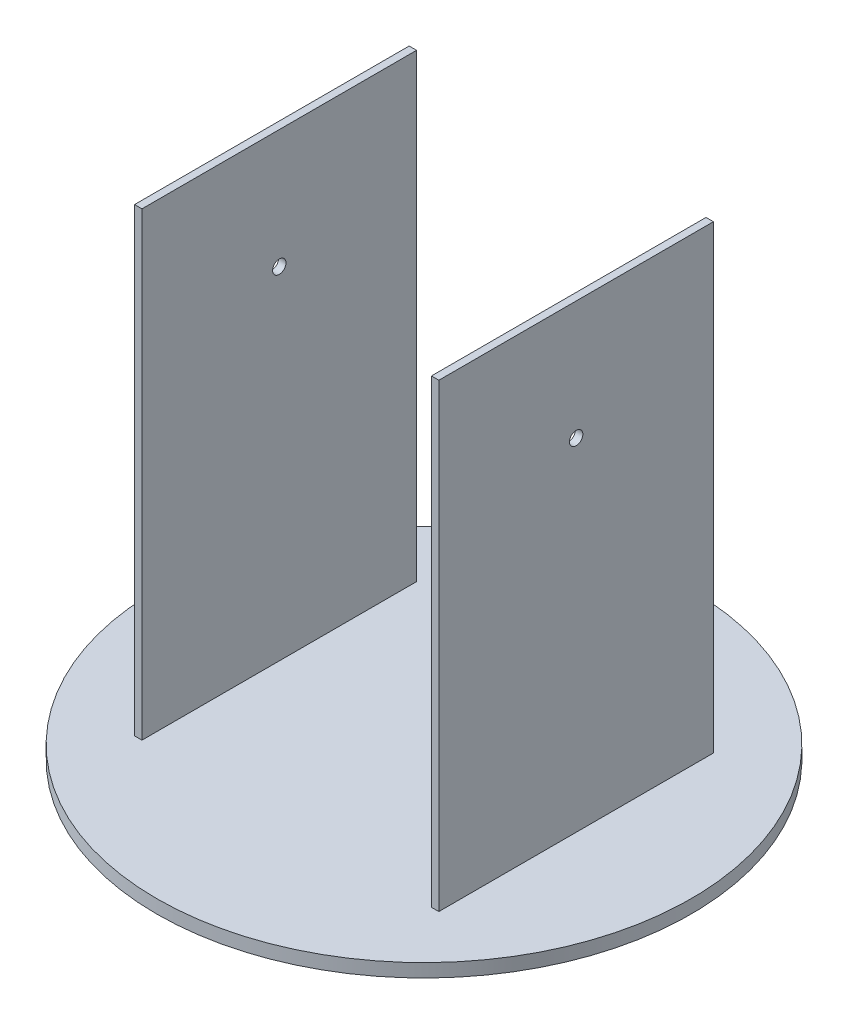
ISO-10303-21;
HEADER;
FILE_DESCRIPTION(('STEP AP214'),'2;1');
FILE_NAME('part.step','',(''),(''),'','','');
FILE_SCHEMA(('AUTOMOTIVE_DESIGN { 1 0 10303 214 1 1 1 1 }'));
ENDSEC;
DATA;
#1=APPLICATION_CONTEXT('core data for automotive mechanical design processes');
#2=APPLICATION_PROTOCOL_DEFINITION('international standard','automotive_design',2000,#1);
#3=PRODUCT_CONTEXT('',#1,'mechanical');
#4=PRODUCT('Part','Part','',(#3));
#5=PRODUCT_RELATED_PRODUCT_CATEGORY('part','',(#4));
#6=PRODUCT_DEFINITION_FORMATION('','',#4);
#7=PRODUCT_DEFINITION_CONTEXT('part definition',#1,'design');
#8=PRODUCT_DEFINITION('design','',#6,#7);
#9=PRODUCT_DEFINITION_SHAPE('','',#8);
#10=(LENGTH_UNIT() NAMED_UNIT(*) SI_UNIT(.MILLI.,.METRE.));
#11=(NAMED_UNIT(*) PLANE_ANGLE_UNIT() SI_UNIT($,.RADIAN.));
#12=(NAMED_UNIT(*) SI_UNIT($,.STERADIAN.) SOLID_ANGLE_UNIT());
#13=UNCERTAINTY_MEASURE_WITH_UNIT(LENGTH_MEASURE(1.E-05),#10,'distance_accuracy_value','');
#14=(GEOMETRIC_REPRESENTATION_CONTEXT(3) GLOBAL_UNCERTAINTY_ASSIGNED_CONTEXT((#13)) GLOBAL_UNIT_ASSIGNED_CONTEXT((#10,
#11,#12)) REPRESENTATION_CONTEXT('',''));
#15=CARTESIAN_POINT('',(0.,0.,0.));
#16=DIRECTION('',(0.,0.,1.));
#17=DIRECTION('',(1.,0.,0.));
#18=AXIS2_PLACEMENT_3D('',#15,#16,#17);
#19=CARTESIAN_POINT('',(0.,0.,0.));
#20=DIRECTION('',(0.,1.,0.));
#21=DIRECTION('',(0.,0.,1.));
#22=AXIS2_PLACEMENT_3D('',#19,#20,#21);
#23=PLANE('',#22);
#24=DIRECTION('',(0.,0.,-1.));
#25=VECTOR('',#24,1.);
#26=CARTESIAN_POINT('',(-102.5,0.,92.5000000000001));
#27=LINE('',#26,#25);
#28=CARTESIAN_POINT('',(-102.5,0.,92.5000000000001));
#29=VERTEX_POINT('',#28);
#30=CARTESIAN_POINT('',(-102.5,0.,-92.4999999999999));
#31=VERTEX_POINT('',#30);
#32=EDGE_CURVE('E103',#29,#31,#27,.T.);
#33=ORIENTED_EDGE('',*,*,#32,.T.);
#34=DIRECTION('',(1.,0.,0.));
#35=VECTOR('',#34,1.);
#36=CARTESIAN_POINT('',(-102.5,0.,-92.4999999999999));
#37=LINE('',#36,#35);
#38=CARTESIAN_POINT('',(-97.5,0.,-92.4999999999999));
#39=VERTEX_POINT('',#38);
#40=EDGE_CURVE('E143',#31,#39,#37,.T.);
#41=ORIENTED_EDGE('',*,*,#40,.T.);
#42=DIRECTION('',(0.,0.,1.));
#43=VECTOR('',#42,1.);
#44=CARTESIAN_POINT('',(-97.5,0.,-92.4999999999999));
#45=LINE('',#44,#43);
#46=CARTESIAN_POINT('',(-97.5,0.,92.5000000000001));
#47=VERTEX_POINT('',#46);
#48=EDGE_CURVE('E145',#39,#47,#45,.T.);
#49=ORIENTED_EDGE('',*,*,#48,.T.);
#50=DIRECTION('',(1.,0.,0.));
#51=VECTOR('',#50,1.);
#52=CARTESIAN_POINT('',(-102.5,0.,92.5000000000001));
#53=LINE('',#52,#51);
#54=EDGE_CURVE('E133',#29,#47,#53,.T.);
#55=ORIENTED_EDGE('',*,*,#54,.F.);
#56=EDGE_LOOP('',(#33,#41,#49,#55));
#57=FACE_BOUND('',#56,.T.);
#58=CARTESIAN_POINT('',(0.,0.,0.));
#59=DIRECTION('',(0.,1.,0.));
#60=DIRECTION('',(0.,0.,1.));
#61=AXIS2_PLACEMENT_3D('',#58,#59,#60);
#62=CIRCLE('',#61,180.);
#63=CARTESIAN_POINT('',(0.,0.,180.));
#64=VERTEX_POINT('',#63);
#65=EDGE_CURVE('E42',#64,#64,#62,.T.);
#66=ORIENTED_EDGE('',*,*,#65,.T.);
#67=EDGE_LOOP('',(#66));
#68=FACE_BOUND('',#67,.T.);
#69=DIRECTION('',(1.,0.,0.));
#70=VECTOR('',#69,1.);
#71=CARTESIAN_POINT('',(97.4999999999999,0.,92.5000000000001));
#72=LINE('',#71,#70);
#73=CARTESIAN_POINT('',(97.4999999999999,0.,92.5000000000001));
#74=VERTEX_POINT('',#73);
#75=CARTESIAN_POINT('',(102.5,0.,92.5000000000001));
#76=VERTEX_POINT('',#75);
#77=EDGE_CURVE('E50',#74,#76,#72,.T.);
#78=ORIENTED_EDGE('',*,*,#77,.F.);
#79=DIRECTION('',(0.,0.,1.));
#80=VECTOR('',#79,1.);
#81=CARTESIAN_POINT('',(97.5,0.,-92.4999999999999));
#82=LINE('',#81,#80);
#83=CARTESIAN_POINT('',(97.5,0.,-92.4999999999999));
#84=VERTEX_POINT('',#83);
#85=EDGE_CURVE('E96',#84,#74,#82,.T.);
#86=ORIENTED_EDGE('',*,*,#85,.F.);
#87=DIRECTION('',(1.,0.,0.));
#88=VECTOR('',#87,1.);
#89=CARTESIAN_POINT('',(97.5,0.,-92.4999999999999));
#90=LINE('',#89,#88);
#91=CARTESIAN_POINT('',(102.5,0.,-92.4999999999999));
#92=VERTEX_POINT('',#91);
#93=EDGE_CURVE('E99',#84,#92,#90,.T.);
#94=ORIENTED_EDGE('',*,*,#93,.T.);
#95=DIRECTION('',(0.,0.,-1.));
#96=VECTOR('',#95,1.);
#97=CARTESIAN_POINT('',(102.5,0.,92.5000000000001));
#98=LINE('',#97,#96);
#99=EDGE_CURVE('E55',#76,#92,#98,.T.);
#100=ORIENTED_EDGE('',*,*,#99,.F.);
#101=EDGE_LOOP('',(#78,#86,#94,#100));
#102=FACE_BOUND('',#101,.T.);
#103=ADVANCED_FACE('F33',(#57,#68,#102),#23,.T.);
#104=CARTESIAN_POINT('',(0.,-9.,0.));
#105=DIRECTION('',(0.,1.,0.));
#106=DIRECTION('',(0.,0.,1.));
#107=AXIS2_PLACEMENT_3D('',#104,#105,#106);
#108=CYLINDRICAL_SURFACE('',#107,180.);
#109=CARTESIAN_POINT('',(0.,-9.,0.));
#110=DIRECTION('',(0.,1.,0.));
#111=DIRECTION('',(0.,0.,1.));
#112=AXIS2_PLACEMENT_3D('',#109,#110,#111);
#113=CIRCLE('',#112,180.);
#114=CARTESIAN_POINT('',(0.,-9.,180.));
#115=VERTEX_POINT('',#114);
#116=EDGE_CURVE('E11',#115,#115,#113,.T.);
#117=ORIENTED_EDGE('',*,*,#116,.T.);
#118=EDGE_LOOP('',(#117));
#119=FACE_BOUND('',#118,.T.);
#120=ORIENTED_EDGE('',*,*,#65,.F.);
#121=EDGE_LOOP('',(#120));
#122=FACE_BOUND('',#121,.T.);
#123=ADVANCED_FACE('F35',(#119,#122),#108,.T.);
#124=CARTESIAN_POINT('',(0.,-9.,0.));
#125=DIRECTION('',(0.,1.,0.));
#126=DIRECTION('',(0.,0.,1.));
#127=AXIS2_PLACEMENT_3D('',#124,#125,#126);
#128=PLANE('',#127);
#129=ORIENTED_EDGE('',*,*,#116,.F.);
#130=EDGE_LOOP('',(#129));
#131=FACE_BOUND('',#130,.T.);
#132=ADVANCED_FACE('F164',(#131),#128,.F.);
#133=CARTESIAN_POINT('',(-102.5,310.,92.5000000000001));
#134=DIRECTION('',(-1.,0.,0.));
#135=DIRECTION('',(0.,0.,1.));
#136=AXIS2_PLACEMENT_3D('',#133,#134,#135);
#137=PLANE('',#136);
#138=CARTESIAN_POINT('',(-102.5,230.,0.));
#139=DIRECTION('',(-1.,0.,0.));
#140=DIRECTION('',(0.,0.,1.));
#141=AXIS2_PLACEMENT_3D('',#138,#139,#140);
#142=CIRCLE('',#141,4.5);
#143=CARTESIAN_POINT('',(-102.5,230.,4.50000000000007));
#144=VERTEX_POINT('',#143);
#145=EDGE_CURVE('E231',#144,#144,#142,.T.);
#146=ORIENTED_EDGE('',*,*,#145,.F.);
#147=EDGE_LOOP('',(#146));
#148=FACE_BOUND('',#147,.T.);
#149=ORIENTED_EDGE('',*,*,#32,.F.);
#150=DIRECTION('',(0.,-1.,0.));
#151=VECTOR('',#150,1.);
#152=CARTESIAN_POINT('',(-102.5,310.,92.5000000000001));
#153=LINE('',#152,#151);
#154=CARTESIAN_POINT('',(-102.5,310.,92.5000000000001));
#155=VERTEX_POINT('',#154);
#156=EDGE_CURVE('E149',#155,#29,#153,.T.);
#157=ORIENTED_EDGE('',*,*,#156,.F.);
#158=DIRECTION('',(0.,0.,-1.));
#159=VECTOR('',#158,1.);
#160=CARTESIAN_POINT('',(-102.5,310.,92.5000000000001));
#161=LINE('',#160,#159);
#162=CARTESIAN_POINT('',(-102.5,310.,-92.4999999999999));
#163=VERTEX_POINT('',#162);
#164=EDGE_CURVE('E129',#155,#163,#161,.T.);
#165=ORIENTED_EDGE('',*,*,#164,.T.);
#166=DIRECTION('',(0.,-1.,0.));
#167=VECTOR('',#166,1.);
#168=CARTESIAN_POINT('',(-102.5,310.,-92.4999999999999));
#169=LINE('',#168,#167);
#170=EDGE_CURVE('E141',#163,#31,#169,.T.);
#171=ORIENTED_EDGE('',*,*,#170,.T.);
#172=EDGE_LOOP('',(#149,#157,#165,#171));
#173=FACE_BOUND('',#172,.T.);
#174=ADVANCED_FACE('F170',(#148,#173),#137,.T.);
#175=CARTESIAN_POINT('',(-102.5,310.,92.5000000000001));
#176=DIRECTION('',(0.,0.,-1.));
#177=DIRECTION('',(-1.,0.,0.));
#178=AXIS2_PLACEMENT_3D('',#175,#176,#177);
#179=PLANE('',#178);
#180=ORIENTED_EDGE('',*,*,#54,.T.);
#181=DIRECTION('',(0.,-1.,0.));
#182=VECTOR('',#181,1.);
#183=CARTESIAN_POINT('',(-97.5,310.,92.5000000000001));
#184=LINE('',#183,#182);
#185=CARTESIAN_POINT('',(-97.5,310.,92.5000000000001));
#186=VERTEX_POINT('',#185);
#187=EDGE_CURVE('E152',#186,#47,#184,.T.);
#188=ORIENTED_EDGE('',*,*,#187,.F.);
#189=DIRECTION('',(1.,0.,0.));
#190=VECTOR('',#189,1.);
#191=CARTESIAN_POINT('',(-102.5,310.,92.5000000000001));
#192=LINE('',#191,#190);
#193=EDGE_CURVE('E139',#155,#186,#192,.T.);
#194=ORIENTED_EDGE('',*,*,#193,.F.);
#195=ORIENTED_EDGE('',*,*,#156,.T.);
#196=EDGE_LOOP('',(#180,#188,#194,#195));
#197=FACE_BOUND('',#196,.T.);
#198=ADVANCED_FACE('F180',(#197),#179,.F.);
#199=CARTESIAN_POINT('',(-97.5,310.,-92.4999999999999));
#200=DIRECTION('',(1.,0.,0.));
#201=DIRECTION('',(0.,0.,-1.));
#202=AXIS2_PLACEMENT_3D('',#199,#200,#201);
#203=PLANE('',#202);
#204=CARTESIAN_POINT('',(-97.5,230.,0.));
#205=DIRECTION('',(1.,0.,0.));
#206=DIRECTION('',(0.,0.,-1.));
#207=AXIS2_PLACEMENT_3D('',#204,#205,#206);
#208=CIRCLE('',#207,4.5);
#209=CARTESIAN_POINT('',(-97.5,230.,-4.49999999999993));
#210=VERTEX_POINT('',#209);
#211=EDGE_CURVE('E228',#210,#210,#208,.T.);
#212=ORIENTED_EDGE('',*,*,#211,.F.);
#213=EDGE_LOOP('',(#212));
#214=FACE_BOUND('',#213,.T.);
#215=ORIENTED_EDGE('',*,*,#48,.F.);
#216=DIRECTION('',(0.,-1.,0.));
#217=VECTOR('',#216,1.);
#218=CARTESIAN_POINT('',(-97.5,310.,-92.4999999999999));
#219=LINE('',#218,#217);
#220=CARTESIAN_POINT('',(-97.5,310.,-92.4999999999999));
#221=VERTEX_POINT('',#220);
#222=EDGE_CURVE('E155',#221,#39,#219,.T.);
#223=ORIENTED_EDGE('',*,*,#222,.F.);
#224=DIRECTION('',(0.,0.,1.));
#225=VECTOR('',#224,1.);
#226=CARTESIAN_POINT('',(-97.5,310.,-92.4999999999999));
#227=LINE('',#226,#225);
#228=EDGE_CURVE('E136',#221,#186,#227,.T.);
#229=ORIENTED_EDGE('',*,*,#228,.T.);
#230=ORIENTED_EDGE('',*,*,#187,.T.);
#231=EDGE_LOOP('',(#215,#223,#229,#230));
#232=FACE_BOUND('',#231,.T.);
#233=ADVANCED_FACE('F186',(#214,#232),#203,.T.);
#234=CARTESIAN_POINT('',(-102.5,310.,-92.4999999999999));
#235=DIRECTION('',(0.,0.,-1.));
#236=DIRECTION('',(-1.,0.,0.));
#237=AXIS2_PLACEMENT_3D('',#234,#235,#236);
#238=PLANE('',#237);
#239=ORIENTED_EDGE('',*,*,#40,.F.);
#240=ORIENTED_EDGE('',*,*,#170,.F.);
#241=DIRECTION('',(1.,0.,0.));
#242=VECTOR('',#241,1.);
#243=CARTESIAN_POINT('',(-102.5,310.,-92.4999999999999));
#244=LINE('',#243,#242);
#245=EDGE_CURVE('E132',#163,#221,#244,.T.);
#246=ORIENTED_EDGE('',*,*,#245,.T.);
#247=ORIENTED_EDGE('',*,*,#222,.T.);
#248=EDGE_LOOP('',(#239,#240,#246,#247));
#249=FACE_BOUND('',#248,.T.);
#250=ADVANCED_FACE('F182',(#249),#238,.T.);
#251=CARTESIAN_POINT('',(0.,310.,0.));
#252=DIRECTION('',(0.,-1.,0.));
#253=DIRECTION('',(0.,0.,-1.));
#254=AXIS2_PLACEMENT_3D('',#251,#252,#253);
#255=PLANE('',#254);
#256=ORIENTED_EDGE('',*,*,#164,.F.);
#257=ORIENTED_EDGE('',*,*,#193,.T.);
#258=ORIENTED_EDGE('',*,*,#228,.F.);
#259=ORIENTED_EDGE('',*,*,#245,.F.);
#260=EDGE_LOOP('',(#256,#257,#258,#259));
#261=FACE_BOUND('',#260,.T.);
#262=ADVANCED_FACE('F185',(#261),#255,.F.);
#263=CARTESIAN_POINT('',(97.5,310.,-92.4999999999999));
#264=DIRECTION('',(1.,0.,0.));
#265=DIRECTION('',(0.,0.,-1.));
#266=AXIS2_PLACEMENT_3D('',#263,#264,#265);
#267=PLANE('',#266);
#268=CARTESIAN_POINT('',(97.5,230.,0.));
#269=DIRECTION('',(1.,0.,0.));
#270=DIRECTION('',(0.,0.,-1.));
#271=AXIS2_PLACEMENT_3D('',#268,#269,#270);
#272=CIRCLE('',#271,4.5);
#273=CARTESIAN_POINT('',(97.5,230.,-4.49999999999993));
#274=VERTEX_POINT('',#273);
#275=EDGE_CURVE('E227',#274,#274,#272,.T.);
#276=ORIENTED_EDGE('',*,*,#275,.T.);
#277=EDGE_LOOP('',(#276));
#278=FACE_BOUND('',#277,.T.);
#279=ORIENTED_EDGE('',*,*,#85,.T.);
#280=DIRECTION('',(0.,-1.,0.));
#281=VECTOR('',#280,1.);
#282=CARTESIAN_POINT('',(97.4999999999999,310.,92.5000000000001));
#283=LINE('',#282,#281);
#284=CARTESIAN_POINT('',(97.4999999999999,310.,92.5000000000001));
#285=VERTEX_POINT('',#284);
#286=EDGE_CURVE('E236',#285,#74,#283,.T.);
#287=ORIENTED_EDGE('',*,*,#286,.F.);
#288=DIRECTION('',(0.,0.,1.));
#289=VECTOR('',#288,1.);
#290=CARTESIAN_POINT('',(97.5,310.,-92.4999999999999));
#291=LINE('',#290,#289);
#292=CARTESIAN_POINT('',(97.5,310.,-92.4999999999999));
#293=VERTEX_POINT('',#292);
#294=EDGE_CURVE('E109',#293,#285,#291,.T.);
#295=ORIENTED_EDGE('',*,*,#294,.F.);
#296=DIRECTION('',(0.,-1.,0.));
#297=VECTOR('',#296,1.);
#298=CARTESIAN_POINT('',(97.5,310.,-92.4999999999999));
#299=LINE('',#298,#297);
#300=EDGE_CURVE('E106',#293,#84,#299,.T.);
#301=ORIENTED_EDGE('',*,*,#300,.T.);
#302=EDGE_LOOP('',(#279,#287,#295,#301));
#303=FACE_BOUND('',#302,.T.);
#304=ADVANCED_FACE('F107',(#278,#303),#267,.F.);
#305=CARTESIAN_POINT('',(97.4999999999999,310.,92.5000000000001));
#306=DIRECTION('',(0.,0.,-1.));
#307=DIRECTION('',(-1.,0.,0.));
#308=AXIS2_PLACEMENT_3D('',#305,#306,#307);
#309=PLANE('',#308);
#310=ORIENTED_EDGE('',*,*,#77,.T.);
#311=DIRECTION('',(0.,-1.,0.));
#312=VECTOR('',#311,1.);
#313=CARTESIAN_POINT('',(102.5,310.,92.5000000000001));
#314=LINE('',#313,#312);
#315=CARTESIAN_POINT('',(102.5,310.,92.5000000000001));
#316=VERTEX_POINT('',#315);
#317=EDGE_CURVE('E238',#316,#76,#314,.T.);
#318=ORIENTED_EDGE('',*,*,#317,.F.);
#319=DIRECTION('',(1.,0.,0.));
#320=VECTOR('',#319,1.);
#321=CARTESIAN_POINT('',(97.4999999999999,310.,92.5000000000001));
#322=LINE('',#321,#320);
#323=EDGE_CURVE('E120',#285,#316,#322,.T.);
#324=ORIENTED_EDGE('',*,*,#323,.F.);
#325=ORIENTED_EDGE('',*,*,#286,.T.);
#326=EDGE_LOOP('',(#310,#318,#324,#325));
#327=FACE_BOUND('',#326,.T.);
#328=ADVANCED_FACE('F207',(#327),#309,.F.);
#329=CARTESIAN_POINT('',(102.5,310.,92.5000000000001));
#330=DIRECTION('',(-1.,0.,0.));
#331=DIRECTION('',(0.,0.,1.));
#332=AXIS2_PLACEMENT_3D('',#329,#330,#331);
#333=PLANE('',#332);
#334=CARTESIAN_POINT('',(102.5,230.,0.));
#335=DIRECTION('',(-1.,0.,0.));
#336=DIRECTION('',(0.,0.,1.));
#337=AXIS2_PLACEMENT_3D('',#334,#335,#336);
#338=CIRCLE('',#337,4.5);
#339=CARTESIAN_POINT('',(102.5,230.,4.50000000000007));
#340=VERTEX_POINT('',#339);
#341=EDGE_CURVE('E37',#340,#340,#338,.T.);
#342=ORIENTED_EDGE('',*,*,#341,.T.);
#343=EDGE_LOOP('',(#342));
#344=FACE_BOUND('',#343,.T.);
#345=ORIENTED_EDGE('',*,*,#99,.T.);
#346=DIRECTION('',(0.,-1.,0.));
#347=VECTOR('',#346,1.);
#348=CARTESIAN_POINT('',(102.5,310.,-92.4999999999999));
#349=LINE('',#348,#347);
#350=CARTESIAN_POINT('',(102.5,310.,-92.4999999999999));
#351=VERTEX_POINT('',#350);
#352=EDGE_CURVE('E114',#351,#92,#349,.T.);
#353=ORIENTED_EDGE('',*,*,#352,.F.);
#354=DIRECTION('',(0.,0.,-1.));
#355=VECTOR('',#354,1.);
#356=CARTESIAN_POINT('',(102.5,310.,92.5000000000001));
#357=LINE('',#356,#355);
#358=EDGE_CURVE('E126',#316,#351,#357,.T.);
#359=ORIENTED_EDGE('',*,*,#358,.F.);
#360=ORIENTED_EDGE('',*,*,#317,.T.);
#361=EDGE_LOOP('',(#345,#353,#359,#360));
#362=FACE_BOUND('',#361,.T.);
#363=ADVANCED_FACE('F204',(#344,#362),#333,.F.);
#364=CARTESIAN_POINT('',(97.5,310.,-92.4999999999999));
#365=DIRECTION('',(0.,0.,-1.));
#366=DIRECTION('',(-1.,0.,0.));
#367=AXIS2_PLACEMENT_3D('',#364,#365,#366);
#368=PLANE('',#367);
#369=ORIENTED_EDGE('',*,*,#93,.F.);
#370=ORIENTED_EDGE('',*,*,#300,.F.);
#371=DIRECTION('',(1.,0.,0.));
#372=VECTOR('',#371,1.);
#373=CARTESIAN_POINT('',(97.5,310.,-92.4999999999999));
#374=LINE('',#373,#372);
#375=EDGE_CURVE('E113',#293,#351,#374,.T.);
#376=ORIENTED_EDGE('',*,*,#375,.T.);
#377=ORIENTED_EDGE('',*,*,#352,.T.);
#378=EDGE_LOOP('',(#369,#370,#376,#377));
#379=FACE_BOUND('',#378,.T.);
#380=ADVANCED_FACE('F116',(#379),#368,.T.);
#381=CARTESIAN_POINT('',(0.,310.,0.));
#382=DIRECTION('',(0.,1.,0.));
#383=DIRECTION('',(0.,0.,1.));
#384=AXIS2_PLACEMENT_3D('',#381,#382,#383);
#385=PLANE('',#384);
#386=ORIENTED_EDGE('',*,*,#294,.T.);
#387=ORIENTED_EDGE('',*,*,#323,.T.);
#388=ORIENTED_EDGE('',*,*,#358,.T.);
#389=ORIENTED_EDGE('',*,*,#375,.F.);
#390=EDGE_LOOP('',(#386,#387,#388,#389));
#391=FACE_BOUND('',#390,.T.);
#392=ADVANCED_FACE('F197',(#391),#385,.T.);
#393=CARTESIAN_POINT('',(-180.,230.,0.));
#394=DIRECTION('',(1.,0.,0.));
#395=DIRECTION('',(0.,0.,-1.));
#396=AXIS2_PLACEMENT_3D('',#393,#394,#395);
#397=CYLINDRICAL_SURFACE('',#396,4.5);
#398=ORIENTED_EDGE('',*,*,#341,.F.);
#399=EDGE_LOOP('',(#398));
#400=FACE_BOUND('',#399,.T.);
#401=ORIENTED_EDGE('',*,*,#275,.F.);
#402=EDGE_LOOP('',(#401));
#403=FACE_BOUND('',#402,.T.);
#404=ADVANCED_FACE('F200',(#400,#403),#397,.F.);
#405=ORIENTED_EDGE('',*,*,#145,.T.);
#406=EDGE_LOOP('',(#405));
#407=FACE_BOUND('',#406,.T.);
#408=ORIENTED_EDGE('',*,*,#211,.T.);
#409=EDGE_LOOP('',(#408));
#410=FACE_BOUND('',#409,.T.);
#411=ADVANCED_FACE('F216',(#407,#410),#397,.F.);
#412=CLOSED_SHELL('',(#103,#123,#132,#174,#198,#233,#250,#262,#304,#328,#363,#380,#392,#404,#411));
#413=MANIFOLD_SOLID_BREP('B2',#412);
#414=ADVANCED_BREP_SHAPE_REPRESENTATION('',(#18,#413),#14);
#415=SHAPE_DEFINITION_REPRESENTATION(#9,#414);
ENDSEC;
END-ISO-10303-21;
